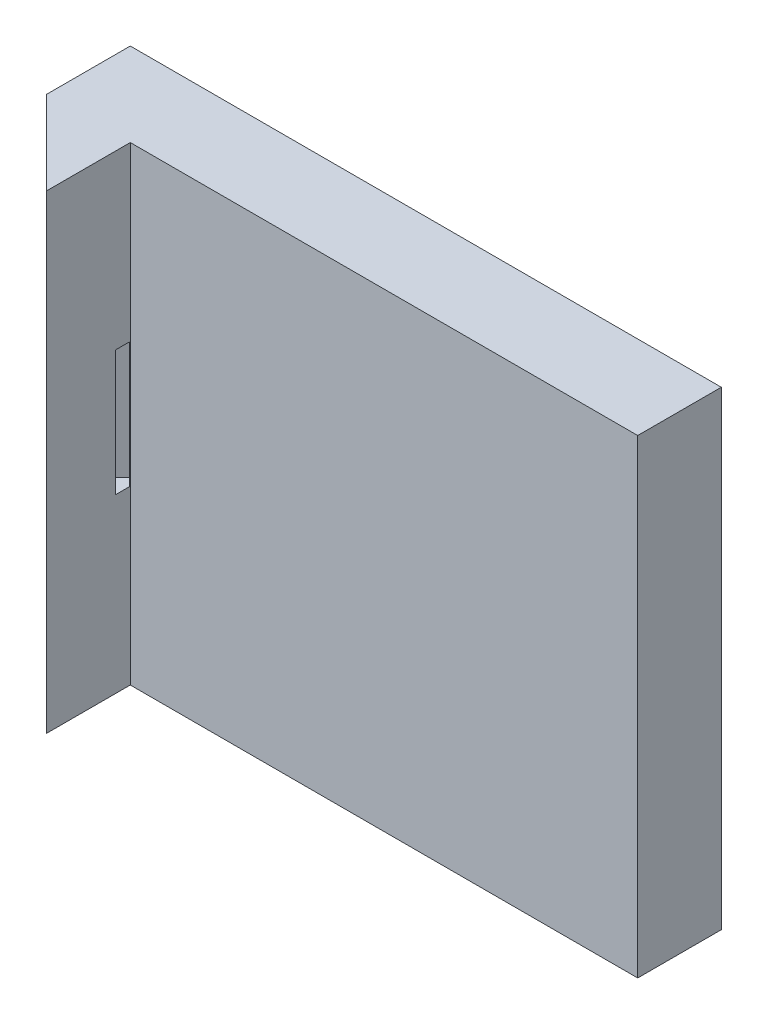
ISO-10303-21;
HEADER;
FILE_DESCRIPTION(('STEP AP214'),'2;1');
FILE_NAME('part.step','',(''),(''),'','','');
FILE_SCHEMA(('AUTOMOTIVE_DESIGN { 1 0 10303 214 1 1 1 1 }'));
ENDSEC;
DATA;
#1=APPLICATION_CONTEXT('core data for automotive mechanical design processes');
#2=APPLICATION_PROTOCOL_DEFINITION('international standard','automotive_design',2000,#1);
#3=PRODUCT_CONTEXT('',#1,'mechanical');
#4=PRODUCT('Part','Part','',(#3));
#5=PRODUCT_RELATED_PRODUCT_CATEGORY('part','',(#4));
#6=PRODUCT_DEFINITION_FORMATION('','',#4);
#7=PRODUCT_DEFINITION_CONTEXT('part definition',#1,'design');
#8=PRODUCT_DEFINITION('design','',#6,#7);
#9=PRODUCT_DEFINITION_SHAPE('','',#8);
#10=(LENGTH_UNIT() NAMED_UNIT(*) SI_UNIT(.MILLI.,.METRE.));
#11=(NAMED_UNIT(*) PLANE_ANGLE_UNIT() SI_UNIT($,.RADIAN.));
#12=(NAMED_UNIT(*) SI_UNIT($,.STERADIAN.) SOLID_ANGLE_UNIT());
#13=UNCERTAINTY_MEASURE_WITH_UNIT(LENGTH_MEASURE(1.E-05),#10,'distance_accuracy_value','');
#14=(GEOMETRIC_REPRESENTATION_CONTEXT(3) GLOBAL_UNCERTAINTY_ASSIGNED_CONTEXT((#13)) GLOBAL_UNIT_ASSIGNED_CONTEXT((#10,
#11,#12)) REPRESENTATION_CONTEXT('',''));
#15=CARTESIAN_POINT('',(0.,0.,0.));
#16=DIRECTION('',(0.,0.,1.));
#17=DIRECTION('',(1.,0.,0.));
#18=AXIS2_PLACEMENT_3D('',#15,#16,#17);
#19=CARTESIAN_POINT('',(0.,0.,10.));
#20=DIRECTION('',(0.,0.,-1.));
#21=DIRECTION('',(-1.,0.,0.));
#22=AXIS2_PLACEMENT_3D('',#19,#20,#21);
#23=PLANE('',#22);
#24=DIRECTION('',(1.,0.,0.));
#25=VECTOR('',#24,1.);
#26=CARTESIAN_POINT('',(-175.,-28.1,10.));
#27=LINE('',#26,#25);
#28=CARTESIAN_POINT('',(-175.,-28.1,10.));
#29=VERTEX_POINT('',#28);
#30=CARTESIAN_POINT('',(-114.3,-28.1,10.));
#31=VERTEX_POINT('',#30);
#32=EDGE_CURVE('E230',#29,#31,#27,.T.);
#33=ORIENTED_EDGE('',*,*,#32,.T.);
#34=DIRECTION('',(0.,-1.,0.));
#35=VECTOR('',#34,1.);
#36=CARTESIAN_POINT('',(-114.3,28.1,10.));
#37=LINE('',#36,#35);
#38=CARTESIAN_POINT('',(-114.3,28.1,10.));
#39=VERTEX_POINT('',#38);
#40=EDGE_CURVE('E239',#39,#31,#37,.T.);
#41=ORIENTED_EDGE('',*,*,#40,.F.);
#42=DIRECTION('',(-1.,0.,0.));
#43=VECTOR('',#42,1.);
#44=CARTESIAN_POINT('',(-175.,28.1,10.));
#45=LINE('',#44,#43);
#46=CARTESIAN_POINT('',(-175.,28.1,10.));
#47=VERTEX_POINT('',#46);
#48=EDGE_CURVE('E229',#39,#47,#45,.T.);
#49=ORIENTED_EDGE('',*,*,#48,.T.);
#50=DIRECTION('',(0.,1.,0.));
#51=VECTOR('',#50,1.);
#52=CARTESIAN_POINT('',(-175.,-28.1,10.));
#53=LINE('',#52,#51);
#54=EDGE_CURVE('E169',#29,#47,#53,.T.);
#55=ORIENTED_EDGE('',*,*,#54,.F.);
#56=EDGE_LOOP('',(#33,#41,#49,#55));
#57=FACE_BOUND('',#56,.T.);
#58=ADVANCED_FACE('F38',(#57),#23,.F.);
#59=CARTESIAN_POINT('',(-175.,28.1,10.));
#60=DIRECTION('',(0.,-1.,0.));
#61=DIRECTION('',(0.,0.,-1.));
#62=AXIS2_PLACEMENT_3D('',#59,#60,#61);
#63=PLANE('',#62);
#64=ORIENTED_EDGE('',*,*,#48,.F.);
#65=DIRECTION('',(0.,0.,1.));
#66=VECTOR('',#65,1.);
#67=CARTESIAN_POINT('',(-114.3,28.1,0.));
#68=LINE('',#67,#66);
#69=CARTESIAN_POINT('',(-114.3,28.1,0.));
#70=VERTEX_POINT('',#69);
#71=EDGE_CURVE('E223',#70,#39,#68,.T.);
#72=ORIENTED_EDGE('',*,*,#71,.F.);
#73=DIRECTION('',(-1.,0.,0.));
#74=VECTOR('',#73,1.);
#75=CARTESIAN_POINT('',(-175.,28.1,0.));
#76=LINE('',#75,#74);
#77=CARTESIAN_POINT('',(-185.,28.1,0.));
#78=VERTEX_POINT('',#77);
#79=EDGE_CURVE('E174',#70,#78,#76,.T.);
#80=ORIENTED_EDGE('',*,*,#79,.T.);
#81=DIRECTION('',(0.,0.,-1.));
#82=VECTOR('',#81,1.);
#83=CARTESIAN_POINT('',(-185.,28.1,0.));
#84=LINE('',#83,#82);
#85=CARTESIAN_POINT('',(-185.,28.1,10.));
#86=VERTEX_POINT('',#85);
#87=EDGE_CURVE('E142',#86,#78,#84,.T.);
#88=ORIENTED_EDGE('',*,*,#87,.F.);
#89=DIRECTION('',(-0.707106781186548,0.,-0.707106781186547));
#90=VECTOR('',#89,1.);
#91=CARTESIAN_POINT('',(-175.,28.1,20.));
#92=LINE('',#91,#90);
#93=CARTESIAN_POINT('',(-175.,28.1,20.));
#94=VERTEX_POINT('',#93);
#95=EDGE_CURVE('E136',#94,#86,#92,.T.);
#96=ORIENTED_EDGE('',*,*,#95,.F.);
#97=DIRECTION('',(0.,0.,-1.));
#98=VECTOR('',#97,1.);
#99=CARTESIAN_POINT('',(-175.,28.1,20.));
#100=LINE('',#99,#98);
#101=EDGE_CURVE('E170',#94,#47,#100,.T.);
#102=ORIENTED_EDGE('',*,*,#101,.T.);
#103=EDGE_LOOP('',(#64,#72,#80,#88,#96,#102));
#104=FACE_BOUND('',#103,.T.);
#105=ADVANCED_FACE('F40',(#104),#63,.F.);
#106=CARTESIAN_POINT('',(-175.,-28.1,10.));
#107=DIRECTION('',(0.,1.,0.));
#108=DIRECTION('',(0.,0.,1.));
#109=AXIS2_PLACEMENT_3D('',#106,#107,#108);
#110=PLANE('',#109);
#111=DIRECTION('',(1.,0.,0.));
#112=VECTOR('',#111,1.);
#113=CARTESIAN_POINT('',(-175.,-28.1,0.));
#114=LINE('',#113,#112);
#115=CARTESIAN_POINT('',(-185.,-28.1,0.));
#116=VERTEX_POINT('',#115);
#117=CARTESIAN_POINT('',(-114.3,-28.1,0.));
#118=VERTEX_POINT('',#117);
#119=EDGE_CURVE('E154',#116,#118,#114,.T.);
#120=ORIENTED_EDGE('',*,*,#119,.T.);
#121=DIRECTION('',(0.,0.,1.));
#122=VECTOR('',#121,1.);
#123=CARTESIAN_POINT('',(-114.3,-28.1,0.));
#124=LINE('',#123,#122);
#125=EDGE_CURVE('E56',#118,#31,#124,.T.);
#126=ORIENTED_EDGE('',*,*,#125,.T.);
#127=ORIENTED_EDGE('',*,*,#32,.F.);
#128=DIRECTION('',(0.,0.,-1.));
#129=VECTOR('',#128,1.);
#130=CARTESIAN_POINT('',(-175.,-28.1,20.));
#131=LINE('',#130,#129);
#132=CARTESIAN_POINT('',(-175.,-28.1,20.));
#133=VERTEX_POINT('',#132);
#134=EDGE_CURVE('E151',#133,#29,#131,.T.);
#135=ORIENTED_EDGE('',*,*,#134,.F.);
#136=DIRECTION('',(-0.707106781186548,0.,-0.707106781186547));
#137=VECTOR('',#136,1.);
#138=CARTESIAN_POINT('',(-175.,-28.1,20.));
#139=LINE('',#138,#137);
#140=CARTESIAN_POINT('',(-185.,-28.1,10.));
#141=VERTEX_POINT('',#140);
#142=EDGE_CURVE('E133',#133,#141,#139,.T.);
#143=ORIENTED_EDGE('',*,*,#142,.T.);
#144=DIRECTION('',(0.,0.,1.));
#145=VECTOR('',#144,1.);
#146=CARTESIAN_POINT('',(-185.,-28.1,0.));
#147=LINE('',#146,#145);
#148=EDGE_CURVE('E143',#116,#141,#147,.T.);
#149=ORIENTED_EDGE('',*,*,#148,.F.);
#150=EDGE_LOOP('',(#120,#126,#127,#135,#143,#149));
#151=FACE_BOUND('',#150,.T.);
#152=ADVANCED_FACE('F148',(#151),#110,.F.);
#153=CARTESIAN_POINT('',(0.,0.,0.));
#154=DIRECTION('',(0.,0.,-1.));
#155=DIRECTION('',(-1.,0.,0.));
#156=AXIS2_PLACEMENT_3D('',#153,#154,#155);
#157=PLANE('',#156);
#158=DIRECTION('',(0.,-1.,0.));
#159=VECTOR('',#158,1.);
#160=CARTESIAN_POINT('',(-114.3,28.1,0.));
#161=LINE('',#160,#159);
#162=EDGE_CURVE('E249',#70,#118,#161,.T.);
#163=ORIENTED_EDGE('',*,*,#162,.T.);
#164=ORIENTED_EDGE('',*,*,#119,.F.);
#165=DIRECTION('',(0.,-1.,0.));
#166=VECTOR('',#165,1.);
#167=CARTESIAN_POINT('',(-185.,-28.1,0.));
#168=LINE('',#167,#166);
#169=EDGE_CURVE('E158',#78,#116,#168,.T.);
#170=ORIENTED_EDGE('',*,*,#169,.F.);
#171=ORIENTED_EDGE('',*,*,#79,.F.);
#172=EDGE_LOOP('',(#163,#164,#170,#171));
#173=FACE_BOUND('',#172,.T.);
#174=ADVANCED_FACE('F248',(#173),#157,.T.);
#175=CARTESIAN_POINT('',(-185.,0.,0.));
#176=DIRECTION('',(1.,0.,0.));
#177=DIRECTION('',(0.,0.,-1.));
#178=AXIS2_PLACEMENT_3D('',#175,#176,#177);
#179=PLANE('',#178);
#180=ORIENTED_EDGE('',*,*,#148,.T.);
#181=DIRECTION('',(0.,1.,0.));
#182=VECTOR('',#181,1.);
#183=CARTESIAN_POINT('',(-185.,-28.1,10.));
#184=LINE('',#183,#182);
#185=EDGE_CURVE('E130',#141,#86,#184,.T.);
#186=ORIENTED_EDGE('',*,*,#185,.T.);
#187=ORIENTED_EDGE('',*,*,#87,.T.);
#188=ORIENTED_EDGE('',*,*,#169,.T.);
#189=EDGE_LOOP('',(#180,#186,#187,#188));
#190=FACE_BOUND('',#189,.T.);
#191=ADVANCED_FACE('F156',(#190),#179,.F.);
#192=CARTESIAN_POINT('',(-175.,-28.1,20.));
#193=DIRECTION('',(-1.,0.,0.));
#194=DIRECTION('',(0.,0.,1.));
#195=AXIS2_PLACEMENT_3D('',#192,#193,#194);
#196=PLANE('',#195);
#197=DIRECTION('',(0.,0.,1.));
#198=VECTOR('',#197,1.);
#199=CARTESIAN_POINT('',(-175.,-7.5,20.));
#200=LINE('',#199,#198);
#201=CARTESIAN_POINT('',(-175.,-7.5,10.1005050633884));
#202=VERTEX_POINT('',#201);
#203=CARTESIAN_POINT('',(-175.,-7.5,11.7677669529664));
#204=VERTEX_POINT('',#203);
#205=EDGE_CURVE('E166',#202,#204,#200,.T.);
#206=ORIENTED_EDGE('',*,*,#205,.T.);
#207=DIRECTION('',(0.,1.,0.));
#208=VECTOR('',#207,1.);
#209=CARTESIAN_POINT('',(-175.,-28.1,11.7677669529664));
#210=LINE('',#209,#208);
#211=CARTESIAN_POINT('',(-175.,7.5,11.7677669529664));
#212=VERTEX_POINT('',#211);
#213=EDGE_CURVE('E184',#204,#212,#210,.T.);
#214=ORIENTED_EDGE('',*,*,#213,.T.);
#215=DIRECTION('',(0.,0.,-1.));
#216=VECTOR('',#215,1.);
#217=CARTESIAN_POINT('',(-175.,7.5,20.));
#218=LINE('',#217,#216);
#219=CARTESIAN_POINT('',(-175.,7.5,10.1005050633884));
#220=VERTEX_POINT('',#219);
#221=EDGE_CURVE('E178',#212,#220,#218,.T.);
#222=ORIENTED_EDGE('',*,*,#221,.T.);
#223=DIRECTION('',(0.,1.,0.));
#224=VECTOR('',#223,1.);
#225=CARTESIAN_POINT('',(-175.,-28.1,10.1005050633884));
#226=LINE('',#225,#224);
#227=EDGE_CURVE('E85',#202,#220,#226,.T.);
#228=ORIENTED_EDGE('',*,*,#227,.F.);
#229=EDGE_LOOP('',(#206,#214,#222,#228));
#230=FACE_BOUND('',#229,.T.);
#231=ORIENTED_EDGE('',*,*,#54,.T.);
#232=ORIENTED_EDGE('',*,*,#101,.F.);
#233=DIRECTION('',(0.,1.,0.));
#234=VECTOR('',#233,1.);
#235=CARTESIAN_POINT('',(-175.,-28.1,20.));
#236=LINE('',#235,#234);
#237=EDGE_CURVE('E179',#133,#94,#236,.T.);
#238=ORIENTED_EDGE('',*,*,#237,.F.);
#239=ORIENTED_EDGE('',*,*,#134,.T.);
#240=EDGE_LOOP('',(#231,#232,#238,#239));
#241=FACE_BOUND('',#240,.T.);
#242=ADVANCED_FACE('F244',(#230,#241),#196,.F.);
#243=CARTESIAN_POINT('',(-175.,-28.1,20.));
#244=DIRECTION('',(0.707106781186547,0.,-0.707106781186548));
#245=DIRECTION('',(-0.707106781186548,0.,-0.707106781186547));
#246=AXIS2_PLACEMENT_3D('',#243,#244,#245);
#247=PLANE('',#246);
#248=DIRECTION('',(-0.70710678118655,0.,-0.707106781186545));
#249=VECTOR('',#248,1.);
#250=CARTESIAN_POINT('',(-180.883883476483,7.5,14.1161165235168));
#251=LINE('',#250,#249);
#252=CARTESIAN_POINT('',(-179.116116523517,7.5,15.8838834764832));
#253=VERTEX_POINT('',#252);
#254=CARTESIAN_POINT('',(-180.883883476483,7.5,14.1161165235168));
#255=VERTEX_POINT('',#254);
#256=EDGE_CURVE('E196',#253,#255,#251,.T.);
#257=ORIENTED_EDGE('',*,*,#256,.F.);
#258=DIRECTION('',(0.,1.,0.));
#259=VECTOR('',#258,1.);
#260=CARTESIAN_POINT('',(-179.116116523517,7.5,15.8838834764832));
#261=LINE('',#260,#259);
#262=CARTESIAN_POINT('',(-179.116116523517,-7.5,15.8838834764832));
#263=VERTEX_POINT('',#262);
#264=EDGE_CURVE('E105',#263,#253,#261,.T.);
#265=ORIENTED_EDGE('',*,*,#264,.F.);
#266=DIRECTION('',(0.70710678118655,0.,0.707106781186545));
#267=VECTOR('',#266,1.);
#268=CARTESIAN_POINT('',(-180.883883476483,-7.5,14.1161165235168));
#269=LINE('',#268,#267);
#270=CARTESIAN_POINT('',(-180.883883476483,-7.5,14.1161165235168));
#271=VERTEX_POINT('',#270);
#272=EDGE_CURVE('E197',#271,#263,#269,.T.);
#273=ORIENTED_EDGE('',*,*,#272,.F.);
#274=DIRECTION('',(0.,-1.,0.));
#275=VECTOR('',#274,1.);
#276=CARTESIAN_POINT('',(-180.883883476483,7.5,14.1161165235168));
#277=LINE('',#276,#275);
#278=EDGE_CURVE('E48',#255,#271,#277,.T.);
#279=ORIENTED_EDGE('',*,*,#278,.F.);
#280=EDGE_LOOP('',(#257,#265,#273,#279));
#281=FACE_BOUND('',#280,.T.);
#282=ORIENTED_EDGE('',*,*,#95,.T.);
#283=ORIENTED_EDGE('',*,*,#185,.F.);
#284=ORIENTED_EDGE('',*,*,#142,.F.);
#285=ORIENTED_EDGE('',*,*,#237,.T.);
#286=EDGE_LOOP('',(#282,#283,#284,#285));
#287=FACE_BOUND('',#286,.T.);
#288=ADVANCED_FACE('F132',(#281,#287),#247,.F.);
#289=CARTESIAN_POINT('',(-92.5502525316935,0.,92.5502525316942));
#290=DIRECTION('',(-0.707106781186545,0.,0.70710678118655));
#291=DIRECTION('',(0.70710678118655,0.,0.707106781186545));
#292=AXIS2_PLACEMENT_3D('',#289,#290,#291);
#293=PLANE('',#292);
#294=ORIENTED_EDGE('',*,*,#227,.T.);
#295=DIRECTION('',(-0.70710678118655,0.,-0.707106781186545));
#296=VECTOR('',#295,1.);
#297=CARTESIAN_POINT('',(-175.934136008177,7.5,9.16636905521099));
#298=LINE('',#297,#296);
#299=CARTESIAN_POINT('',(-175.934136008177,7.5,9.16636905521099));
#300=VERTEX_POINT('',#299);
#301=EDGE_CURVE('E42',#220,#300,#298,.T.);
#302=ORIENTED_EDGE('',*,*,#301,.T.);
#303=DIRECTION('',(0.,-1.,0.));
#304=VECTOR('',#303,1.);
#305=CARTESIAN_POINT('',(-175.934136008177,7.5,9.16636905521099));
#306=LINE('',#305,#304);
#307=CARTESIAN_POINT('',(-175.934136008177,-7.5,9.16636905521099));
#308=VERTEX_POINT('',#307);
#309=EDGE_CURVE('E215',#300,#308,#306,.T.);
#310=ORIENTED_EDGE('',*,*,#309,.T.);
#311=DIRECTION('',(0.70710678118655,0.,0.707106781186545));
#312=VECTOR('',#311,1.);
#313=CARTESIAN_POINT('',(-175.934136008177,-7.5,9.16636905521099));
#314=LINE('',#313,#312);
#315=EDGE_CURVE('E205',#308,#202,#314,.T.);
#316=ORIENTED_EDGE('',*,*,#315,.T.);
#317=EDGE_LOOP('',(#294,#302,#310,#316));
#318=FACE_BOUND('',#317,.T.);
#319=ADVANCED_FACE('F284',(#318),#293,.T.);
#320=CARTESIAN_POINT('',(-174.166369055211,7.5,10.9341360081774));
#321=DIRECTION('',(0.707106781186548,0.,0.707106781186547));
#322=DIRECTION('',(0.707106781186547,0.,-0.707106781186548));
#323=AXIS2_PLACEMENT_3D('',#320,#321,#322);
#324=PLANE('',#323);
#325=DIRECTION('',(-0.707106781186547,0.,0.707106781186548));
#326=VECTOR('',#325,1.);
#327=CARTESIAN_POINT('',(-174.166369055211,-7.5,10.9341360081774));
#328=LINE('',#327,#326);
#329=EDGE_CURVE('E100',#204,#263,#328,.T.);
#330=ORIENTED_EDGE('',*,*,#329,.T.);
#331=ORIENTED_EDGE('',*,*,#264,.T.);
#332=DIRECTION('',(-0.707106781186547,0.,0.707106781186548));
#333=VECTOR('',#332,1.);
#334=CARTESIAN_POINT('',(-174.166369055211,7.5,10.9341360081774));
#335=LINE('',#334,#333);
#336=EDGE_CURVE('E194',#212,#253,#335,.T.);
#337=ORIENTED_EDGE('',*,*,#336,.F.);
#338=ORIENTED_EDGE('',*,*,#213,.F.);
#339=EDGE_LOOP('',(#330,#331,#337,#338));
#340=FACE_BOUND('',#339,.T.);
#341=ADVANCED_FACE('F286',(#340),#324,.F.);
#342=CARTESIAN_POINT('',(-175.934136008177,-7.5,9.16636905521099));
#343=DIRECTION('',(0.,-1.,0.));
#344=DIRECTION('',(0.,0.,-1.));
#345=AXIS2_PLACEMENT_3D('',#342,#343,#344);
#346=PLANE('',#345);
#347=ORIENTED_EDGE('',*,*,#315,.F.);
#348=DIRECTION('',(-0.707106781186547,0.,0.707106781186548));
#349=VECTOR('',#348,1.);
#350=CARTESIAN_POINT('',(-175.934136008177,-7.5,9.16636905521099));
#351=LINE('',#350,#349);
#352=EDGE_CURVE('E199',#308,#271,#351,.T.);
#353=ORIENTED_EDGE('',*,*,#352,.T.);
#354=ORIENTED_EDGE('',*,*,#272,.T.);
#355=ORIENTED_EDGE('',*,*,#329,.F.);
#356=ORIENTED_EDGE('',*,*,#205,.F.);
#357=EDGE_LOOP('',(#347,#353,#354,#355,#356));
#358=FACE_BOUND('',#357,.T.);
#359=ADVANCED_FACE('F289',(#358),#346,.F.);
#360=CARTESIAN_POINT('',(-175.934136008177,7.5,9.16636905521099));
#361=DIRECTION('',(0.,1.,0.));
#362=DIRECTION('',(0.,0.,1.));
#363=AXIS2_PLACEMENT_3D('',#360,#361,#362);
#364=PLANE('',#363);
#365=ORIENTED_EDGE('',*,*,#336,.T.);
#366=ORIENTED_EDGE('',*,*,#256,.T.);
#367=DIRECTION('',(-0.707106781186547,0.,0.707106781186548));
#368=VECTOR('',#367,1.);
#369=CARTESIAN_POINT('',(-175.934136008177,7.5,9.16636905521099));
#370=LINE('',#369,#368);
#371=EDGE_CURVE('E11',#300,#255,#370,.T.);
#372=ORIENTED_EDGE('',*,*,#371,.F.);
#373=ORIENTED_EDGE('',*,*,#301,.F.);
#374=ORIENTED_EDGE('',*,*,#221,.F.);
#375=EDGE_LOOP('',(#365,#366,#372,#373,#374));
#376=FACE_BOUND('',#375,.T.);
#377=ADVANCED_FACE('F267',(#376),#364,.F.);
#378=CARTESIAN_POINT('',(-175.934136008177,7.5,9.16636905521099));
#379=DIRECTION('',(-0.707106781186548,0.,-0.707106781186547));
#380=DIRECTION('',(-0.707106781186547,0.,0.707106781186548));
#381=AXIS2_PLACEMENT_3D('',#378,#379,#380);
#382=PLANE('',#381);
#383=ORIENTED_EDGE('',*,*,#278,.T.);
#384=ORIENTED_EDGE('',*,*,#352,.F.);
#385=ORIENTED_EDGE('',*,*,#309,.F.);
#386=ORIENTED_EDGE('',*,*,#371,.T.);
#387=EDGE_LOOP('',(#383,#384,#385,#386));
#388=FACE_BOUND('',#387,.T.);
#389=ADVANCED_FACE('F262',(#388),#382,.F.);
#390=CARTESIAN_POINT('',(-114.3,28.1,0.));
#391=DIRECTION('',(-1.,0.,0.));
#392=DIRECTION('',(0.,0.,1.));
#393=AXIS2_PLACEMENT_3D('',#390,#391,#392);
#394=PLANE('',#393);
#395=ORIENTED_EDGE('',*,*,#40,.T.);
#396=ORIENTED_EDGE('',*,*,#125,.F.);
#397=ORIENTED_EDGE('',*,*,#162,.F.);
#398=ORIENTED_EDGE('',*,*,#71,.T.);
#399=EDGE_LOOP('',(#395,#396,#397,#398));
#400=FACE_BOUND('',#399,.T.);
#401=ADVANCED_FACE('F258',(#400),#394,.F.);
#402=CLOSED_SHELL('',(#58,#105,#152,#174,#191,#242,#288,#319,#341,#359,#377,#389,#401));
#403=MANIFOLD_SOLID_BREP('B2',#402);
#404=ADVANCED_BREP_SHAPE_REPRESENTATION('',(#18,#403),#14);
#405=SHAPE_DEFINITION_REPRESENTATION(#9,#404);
ENDSEC;
END-ISO-10303-21;
